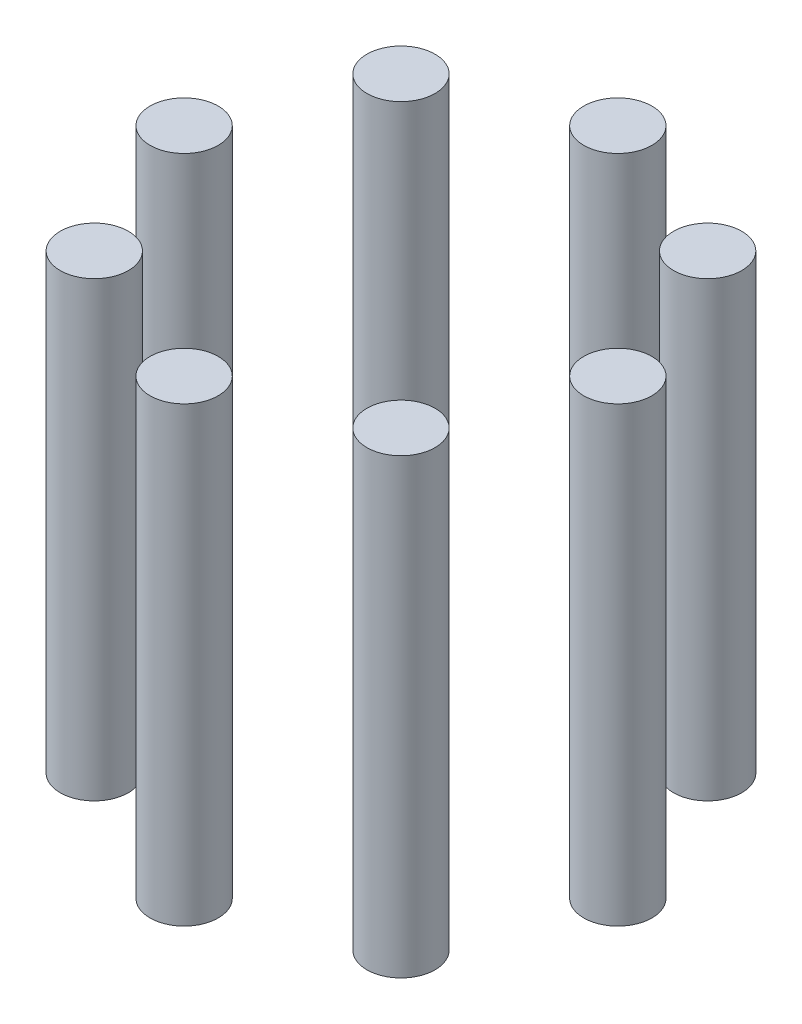
ISO-10303-21;
HEADER;
FILE_DESCRIPTION(('STEP AP214'),'2;1');
FILE_NAME('part.step','',(''),(''),'','','');
FILE_SCHEMA(('AUTOMOTIVE_DESIGN { 1 0 10303 214 1 1 1 1 }'));
ENDSEC;
DATA;
#1=APPLICATION_CONTEXT('core data for automotive mechanical design processes');
#2=APPLICATION_PROTOCOL_DEFINITION('international standard','automotive_design',2000,#1);
#3=PRODUCT_CONTEXT('',#1,'mechanical');
#4=PRODUCT('Part','Part','',(#3));
#5=PRODUCT_RELATED_PRODUCT_CATEGORY('part','',(#4));
#6=PRODUCT_DEFINITION_FORMATION('','',#4);
#7=PRODUCT_DEFINITION_CONTEXT('part definition',#1,'design');
#8=PRODUCT_DEFINITION('design','',#6,#7);
#9=PRODUCT_DEFINITION_SHAPE('','',#8);
#10=(LENGTH_UNIT() NAMED_UNIT(*) SI_UNIT(.MILLI.,.METRE.));
#11=(NAMED_UNIT(*) PLANE_ANGLE_UNIT() SI_UNIT($,.RADIAN.));
#12=(NAMED_UNIT(*) SI_UNIT($,.STERADIAN.) SOLID_ANGLE_UNIT());
#13=UNCERTAINTY_MEASURE_WITH_UNIT(LENGTH_MEASURE(1.E-05),#10,'distance_accuracy_value','');
#14=(GEOMETRIC_REPRESENTATION_CONTEXT(3) GLOBAL_UNCERTAINTY_ASSIGNED_CONTEXT((#13)) GLOBAL_UNIT_ASSIGNED_CONTEXT((#10,
#11,#12)) REPRESENTATION_CONTEXT('',''));
#15=CARTESIAN_POINT('',(0.,0.,0.));
#16=DIRECTION('',(0.,0.,1.));
#17=DIRECTION('',(1.,0.,0.));
#18=AXIS2_PLACEMENT_3D('',#15,#16,#17);
#19=CARTESIAN_POINT('',(-24.7487373415295,73.,24.7487373415289));
#20=DIRECTION('',(0.,-1.,0.));
#21=DIRECTION('',(0.,0.,-1.));
#22=AXIS2_PLACEMENT_3D('',#19,#20,#21);
#23=CYLINDRICAL_SURFACE('',#22,5.5);
#24=CARTESIAN_POINT('',(-24.7487373415295,73.,24.7487373415289));
#25=DIRECTION('',(0.,1.,0.));
#26=DIRECTION('',(0.,0.,1.));
#27=AXIS2_PLACEMENT_3D('',#24,#25,#26);
#28=CIRCLE('',#27,5.5);
#29=CARTESIAN_POINT('',(-24.7487373415295,73.,30.2487373415289));
#30=VERTEX_POINT('',#29);
#31=EDGE_CURVE('E48',#30,#30,#28,.T.);
#32=ORIENTED_EDGE('',*,*,#31,.F.);
#33=EDGE_LOOP('',(#32));
#34=FACE_BOUND('',#33,.T.);
#35=CARTESIAN_POINT('',(-24.7487373415295,0.,24.7487373415289));
#36=DIRECTION('',(0.,1.,0.));
#37=DIRECTION('',(0.,0.,1.));
#38=AXIS2_PLACEMENT_3D('',#35,#36,#37);
#39=CIRCLE('',#38,5.5);
#40=CARTESIAN_POINT('',(-24.7487373415295,0.,30.2487373415289));
#41=VERTEX_POINT('',#40);
#42=EDGE_CURVE('E11',#41,#41,#39,.T.);
#43=ORIENTED_EDGE('',*,*,#42,.T.);
#44=EDGE_LOOP('',(#43));
#45=FACE_BOUND('',#44,.T.);
#46=ADVANCED_FACE('F44',(#34,#45),#23,.T.);
#47=CARTESIAN_POINT('',(-24.7487373415295,73.,24.7487373415289));
#48=DIRECTION('',(0.,1.,0.));
#49=DIRECTION('',(0.,0.,1.));
#50=AXIS2_PLACEMENT_3D('',#47,#48,#49);
#51=PLANE('',#50);
#52=ORIENTED_EDGE('',*,*,#31,.T.);
#53=EDGE_LOOP('',(#52));
#54=FACE_BOUND('',#53,.T.);
#55=ADVANCED_FACE('F46',(#54),#51,.T.);
#56=CARTESIAN_POINT('',(-24.7487373415295,0.,24.7487373415289));
#57=DIRECTION('',(0.,1.,0.));
#58=DIRECTION('',(0.,0.,1.));
#59=AXIS2_PLACEMENT_3D('',#56,#57,#58);
#60=PLANE('',#59);
#61=ORIENTED_EDGE('',*,*,#42,.F.);
#62=EDGE_LOOP('',(#61));
#63=FACE_BOUND('',#62,.T.);
#64=ADVANCED_FACE('F63',(#63),#60,.F.);
#65=CLOSED_SHELL('',(#46,#55,#64));
#66=MANIFOLD_SOLID_BREP('B2',#65);
#67=CARTESIAN_POINT('',(-3.66605540578529E-13,73.,35.));
#68=DIRECTION('',(0.,-1.,0.));
#69=DIRECTION('',(0.,0.,-1.));
#70=AXIS2_PLACEMENT_3D('',#67,#68,#69);
#71=CYLINDRICAL_SURFACE('',#70,5.5);
#72=CARTESIAN_POINT('',(-3.66605540578529E-13,73.,35.));
#73=DIRECTION('',(0.,1.,0.));
#74=DIRECTION('',(0.,0.,1.));
#75=AXIS2_PLACEMENT_3D('',#72,#73,#74);
#76=CIRCLE('',#75,5.5);
#77=CARTESIAN_POINT('',(-3.66605540578529E-13,73.,40.5));
#78=VERTEX_POINT('',#77);
#79=EDGE_CURVE('E103',#78,#78,#76,.T.);
#80=ORIENTED_EDGE('',*,*,#79,.F.);
#81=EDGE_LOOP('',(#80));
#82=FACE_BOUND('',#81,.T.);
#83=CARTESIAN_POINT('',(-3.66605540578529E-13,0.,35.));
#84=DIRECTION('',(0.,1.,0.));
#85=DIRECTION('',(0.,0.,1.));
#86=AXIS2_PLACEMENT_3D('',#83,#84,#85);
#87=CIRCLE('',#86,5.5);
#88=CARTESIAN_POINT('',(-3.66605540578529E-13,0.,40.5));
#89=VERTEX_POINT('',#88);
#90=EDGE_CURVE('E43',#89,#89,#87,.T.);
#91=ORIENTED_EDGE('',*,*,#90,.T.);
#92=EDGE_LOOP('',(#91));
#93=FACE_BOUND('',#92,.T.);
#94=ADVANCED_FACE('F99',(#82,#93),#71,.T.);
#95=CARTESIAN_POINT('',(-3.66605540578529E-13,73.,35.));
#96=DIRECTION('',(0.,1.,0.));
#97=DIRECTION('',(0.,0.,1.));
#98=AXIS2_PLACEMENT_3D('',#95,#96,#97);
#99=PLANE('',#98);
#100=ORIENTED_EDGE('',*,*,#79,.T.);
#101=EDGE_LOOP('',(#100));
#102=FACE_BOUND('',#101,.T.);
#103=ADVANCED_FACE('F101',(#102),#99,.T.);
#104=CARTESIAN_POINT('',(-3.66605540578529E-13,0.,35.));
#105=DIRECTION('',(0.,1.,0.));
#106=DIRECTION('',(0.,0.,1.));
#107=AXIS2_PLACEMENT_3D('',#104,#105,#106);
#108=PLANE('',#107);
#109=ORIENTED_EDGE('',*,*,#90,.F.);
#110=EDGE_LOOP('',(#109));
#111=FACE_BOUND('',#110,.T.);
#112=ADVANCED_FACE('F118',(#111),#108,.F.);
#113=CLOSED_SHELL('',(#94,#103,#112));
#114=MANIFOLD_SOLID_BREP('B6',#113);
#115=CARTESIAN_POINT('',(24.748737341529,73.,24.7487373415294));
#116=DIRECTION('',(0.,-1.,0.));
#117=DIRECTION('',(0.,0.,-1.));
#118=AXIS2_PLACEMENT_3D('',#115,#116,#117);
#119=CYLINDRICAL_SURFACE('',#118,5.5);
#120=CARTESIAN_POINT('',(24.748737341529,73.,24.7487373415294));
#121=DIRECTION('',(0.,1.,0.));
#122=DIRECTION('',(0.,0.,1.));
#123=AXIS2_PLACEMENT_3D('',#120,#121,#122);
#124=CIRCLE('',#123,5.5);
#125=CARTESIAN_POINT('',(24.748737341529,73.,30.2487373415294));
#126=VERTEX_POINT('',#125);
#127=EDGE_CURVE('E158',#126,#126,#124,.T.);
#128=ORIENTED_EDGE('',*,*,#127,.F.);
#129=EDGE_LOOP('',(#128));
#130=FACE_BOUND('',#129,.T.);
#131=CARTESIAN_POINT('',(24.748737341529,0.,24.7487373415294));
#132=DIRECTION('',(0.,1.,0.));
#133=DIRECTION('',(0.,0.,1.));
#134=AXIS2_PLACEMENT_3D('',#131,#132,#133);
#135=CIRCLE('',#134,5.5);
#136=CARTESIAN_POINT('',(24.748737341529,0.,30.2487373415294));
#137=VERTEX_POINT('',#136);
#138=EDGE_CURVE('E98',#137,#137,#135,.T.);
#139=ORIENTED_EDGE('',*,*,#138,.T.);
#140=EDGE_LOOP('',(#139));
#141=FACE_BOUND('',#140,.T.);
#142=ADVANCED_FACE('F154',(#130,#141),#119,.T.);
#143=CARTESIAN_POINT('',(24.748737341529,73.,24.7487373415294));
#144=DIRECTION('',(0.,1.,0.));
#145=DIRECTION('',(0.,0.,1.));
#146=AXIS2_PLACEMENT_3D('',#143,#144,#145);
#147=PLANE('',#146);
#148=ORIENTED_EDGE('',*,*,#127,.T.);
#149=EDGE_LOOP('',(#148));
#150=FACE_BOUND('',#149,.T.);
#151=ADVANCED_FACE('F156',(#150),#147,.T.);
#152=CARTESIAN_POINT('',(24.748737341529,0.,24.7487373415294));
#153=DIRECTION('',(0.,1.,0.));
#154=DIRECTION('',(0.,0.,1.));
#155=AXIS2_PLACEMENT_3D('',#152,#153,#154);
#156=PLANE('',#155);
#157=ORIENTED_EDGE('',*,*,#138,.F.);
#158=EDGE_LOOP('',(#157));
#159=FACE_BOUND('',#158,.T.);
#160=ADVANCED_FACE('F173',(#159),#156,.F.);
#161=CLOSED_SHELL('',(#142,#151,#160));
#162=MANIFOLD_SOLID_BREP('B38',#161);
#163=CARTESIAN_POINT('',(35.,73.,2.44403693719019E-13));
#164=DIRECTION('',(0.,-1.,0.));
#165=DIRECTION('',(0.,0.,-1.));
#166=AXIS2_PLACEMENT_3D('',#163,#164,#165);
#167=CYLINDRICAL_SURFACE('',#166,5.5);
#168=CARTESIAN_POINT('',(35.,73.,2.44403693719019E-13));
#169=DIRECTION('',(0.,1.,0.));
#170=DIRECTION('',(0.,0.,1.));
#171=AXIS2_PLACEMENT_3D('',#168,#169,#170);
#172=CIRCLE('',#171,5.5);
#173=CARTESIAN_POINT('',(35.,73.,5.50000000000024));
#174=VERTEX_POINT('',#173);
#175=EDGE_CURVE('E213',#174,#174,#172,.T.);
#176=ORIENTED_EDGE('',*,*,#175,.F.);
#177=EDGE_LOOP('',(#176));
#178=FACE_BOUND('',#177,.T.);
#179=CARTESIAN_POINT('',(35.,0.,2.44403693719019E-13));
#180=DIRECTION('',(0.,1.,0.));
#181=DIRECTION('',(0.,0.,1.));
#182=AXIS2_PLACEMENT_3D('',#179,#180,#181);
#183=CIRCLE('',#182,5.5);
#184=CARTESIAN_POINT('',(35.,0.,5.50000000000024));
#185=VERTEX_POINT('',#184);
#186=EDGE_CURVE('E153',#185,#185,#183,.T.);
#187=ORIENTED_EDGE('',*,*,#186,.T.);
#188=EDGE_LOOP('',(#187));
#189=FACE_BOUND('',#188,.T.);
#190=ADVANCED_FACE('F209',(#178,#189),#167,.T.);
#191=CARTESIAN_POINT('',(35.,73.,2.44403693719019E-13));
#192=DIRECTION('',(0.,1.,0.));
#193=DIRECTION('',(0.,0.,1.));
#194=AXIS2_PLACEMENT_3D('',#191,#192,#193);
#195=PLANE('',#194);
#196=ORIENTED_EDGE('',*,*,#175,.T.);
#197=EDGE_LOOP('',(#196));
#198=FACE_BOUND('',#197,.T.);
#199=ADVANCED_FACE('F211',(#198),#195,.T.);
#200=CARTESIAN_POINT('',(35.,0.,2.44403693719019E-13));
#201=DIRECTION('',(0.,1.,0.));
#202=DIRECTION('',(0.,0.,1.));
#203=AXIS2_PLACEMENT_3D('',#200,#201,#202);
#204=PLANE('',#203);
#205=ORIENTED_EDGE('',*,*,#186,.F.);
#206=EDGE_LOOP('',(#205));
#207=FACE_BOUND('',#206,.T.);
#208=ADVANCED_FACE('F228',(#207),#204,.F.);
#209=CLOSED_SHELL('',(#190,#199,#208));
#210=MANIFOLD_SOLID_BREP('B93',#209);
#211=CARTESIAN_POINT('',(24.7487373415293,73.,-24.748737341529));
#212=DIRECTION('',(0.,-1.,0.));
#213=DIRECTION('',(0.,0.,-1.));
#214=AXIS2_PLACEMENT_3D('',#211,#212,#213);
#215=CYLINDRICAL_SURFACE('',#214,5.5);
#216=CARTESIAN_POINT('',(24.7487373415293,73.,-24.748737341529));
#217=DIRECTION('',(0.,1.,0.));
#218=DIRECTION('',(0.,0.,1.));
#219=AXIS2_PLACEMENT_3D('',#216,#217,#218);
#220=CIRCLE('',#219,5.5);
#221=CARTESIAN_POINT('',(24.7487373415293,73.,-19.248737341529));
#222=VERTEX_POINT('',#221);
#223=EDGE_CURVE('E268',#222,#222,#220,.T.);
#224=ORIENTED_EDGE('',*,*,#223,.F.);
#225=EDGE_LOOP('',(#224));
#226=FACE_BOUND('',#225,.T.);
#227=CARTESIAN_POINT('',(24.7487373415293,0.,-24.748737341529));
#228=DIRECTION('',(0.,1.,0.));
#229=DIRECTION('',(0.,0.,1.));
#230=AXIS2_PLACEMENT_3D('',#227,#228,#229);
#231=CIRCLE('',#230,5.5);
#232=CARTESIAN_POINT('',(24.7487373415293,0.,-19.248737341529));
#233=VERTEX_POINT('',#232);
#234=EDGE_CURVE('E208',#233,#233,#231,.T.);
#235=ORIENTED_EDGE('',*,*,#234,.T.);
#236=EDGE_LOOP('',(#235));
#237=FACE_BOUND('',#236,.T.);
#238=ADVANCED_FACE('F264',(#226,#237),#215,.T.);
#239=CARTESIAN_POINT('',(24.7487373415293,73.,-24.748737341529));
#240=DIRECTION('',(0.,1.,0.));
#241=DIRECTION('',(0.,0.,1.));
#242=AXIS2_PLACEMENT_3D('',#239,#240,#241);
#243=PLANE('',#242);
#244=ORIENTED_EDGE('',*,*,#223,.T.);
#245=EDGE_LOOP('',(#244));
#246=FACE_BOUND('',#245,.T.);
#247=ADVANCED_FACE('F266',(#246),#243,.T.);
#248=CARTESIAN_POINT('',(24.7487373415293,0.,-24.748737341529));
#249=DIRECTION('',(0.,1.,0.));
#250=DIRECTION('',(0.,0.,1.));
#251=AXIS2_PLACEMENT_3D('',#248,#249,#250);
#252=PLANE('',#251);
#253=ORIENTED_EDGE('',*,*,#234,.F.);
#254=EDGE_LOOP('',(#253));
#255=FACE_BOUND('',#254,.T.);
#256=ADVANCED_FACE('F283',(#255),#252,.F.);
#257=CLOSED_SHELL('',(#238,#247,#256));
#258=MANIFOLD_SOLID_BREP('B148',#257);
#259=CARTESIAN_POINT('',(1.2220184685951E-13,73.,-35.));
#260=DIRECTION('',(0.,-1.,0.));
#261=DIRECTION('',(0.,0.,-1.));
#262=AXIS2_PLACEMENT_3D('',#259,#260,#261);
#263=CYLINDRICAL_SURFACE('',#262,5.5);
#264=CARTESIAN_POINT('',(1.2220184685951E-13,73.,-35.));
#265=DIRECTION('',(0.,1.,0.));
#266=DIRECTION('',(0.,0.,1.));
#267=AXIS2_PLACEMENT_3D('',#264,#265,#266);
#268=CIRCLE('',#267,5.5);
#269=CARTESIAN_POINT('',(1.2220184685951E-13,73.,-29.5));
#270=VERTEX_POINT('',#269);
#271=EDGE_CURVE('E323',#270,#270,#268,.T.);
#272=ORIENTED_EDGE('',*,*,#271,.F.);
#273=EDGE_LOOP('',(#272));
#274=FACE_BOUND('',#273,.T.);
#275=CARTESIAN_POINT('',(1.2220184685951E-13,0.,-35.));
#276=DIRECTION('',(0.,1.,0.));
#277=DIRECTION('',(0.,0.,1.));
#278=AXIS2_PLACEMENT_3D('',#275,#276,#277);
#279=CIRCLE('',#278,5.5);
#280=CARTESIAN_POINT('',(1.2220184685951E-13,0.,-29.5));
#281=VERTEX_POINT('',#280);
#282=EDGE_CURVE('E263',#281,#281,#279,.T.);
#283=ORIENTED_EDGE('',*,*,#282,.T.);
#284=EDGE_LOOP('',(#283));
#285=FACE_BOUND('',#284,.T.);
#286=ADVANCED_FACE('F319',(#274,#285),#263,.T.);
#287=CARTESIAN_POINT('',(1.2220184685951E-13,73.,-35.));
#288=DIRECTION('',(0.,1.,0.));
#289=DIRECTION('',(0.,0.,1.));
#290=AXIS2_PLACEMENT_3D('',#287,#288,#289);
#291=PLANE('',#290);
#292=ORIENTED_EDGE('',*,*,#271,.T.);
#293=EDGE_LOOP('',(#292));
#294=FACE_BOUND('',#293,.T.);
#295=ADVANCED_FACE('F321',(#294),#291,.T.);
#296=CARTESIAN_POINT('',(1.2220184685951E-13,0.,-35.));
#297=DIRECTION('',(0.,1.,0.));
#298=DIRECTION('',(0.,0.,1.));
#299=AXIS2_PLACEMENT_3D('',#296,#297,#298);
#300=PLANE('',#299);
#301=ORIENTED_EDGE('',*,*,#282,.F.);
#302=EDGE_LOOP('',(#301));
#303=FACE_BOUND('',#302,.T.);
#304=ADVANCED_FACE('F338',(#303),#300,.F.);
#305=CLOSED_SHELL('',(#286,#295,#304));
#306=MANIFOLD_SOLID_BREP('B203',#305);
#307=CARTESIAN_POINT('',(-24.7487373415291,73.,-24.7487373415292));
#308=DIRECTION('',(0.,-1.,0.));
#309=DIRECTION('',(0.,0.,-1.));
#310=AXIS2_PLACEMENT_3D('',#307,#308,#309);
#311=CYLINDRICAL_SURFACE('',#310,5.5);
#312=CARTESIAN_POINT('',(-24.7487373415291,73.,-24.7487373415292));
#313=DIRECTION('',(0.,1.,0.));
#314=DIRECTION('',(0.,0.,1.));
#315=AXIS2_PLACEMENT_3D('',#312,#313,#314);
#316=CIRCLE('',#315,5.5);
#317=CARTESIAN_POINT('',(-24.7487373415291,73.,-19.2487373415292));
#318=VERTEX_POINT('',#317);
#319=EDGE_CURVE('E377',#318,#318,#316,.T.);
#320=ORIENTED_EDGE('',*,*,#319,.F.);
#321=EDGE_LOOP('',(#320));
#322=FACE_BOUND('',#321,.T.);
#323=CARTESIAN_POINT('',(-24.7487373415291,0.,-24.7487373415292));
#324=DIRECTION('',(0.,1.,0.));
#325=DIRECTION('',(0.,0.,1.));
#326=AXIS2_PLACEMENT_3D('',#323,#324,#325);
#327=CIRCLE('',#326,5.5);
#328=CARTESIAN_POINT('',(-24.7487373415291,0.,-19.2487373415292));
#329=VERTEX_POINT('',#328);
#330=EDGE_CURVE('E318',#329,#329,#327,.T.);
#331=ORIENTED_EDGE('',*,*,#330,.T.);
#332=EDGE_LOOP('',(#331));
#333=FACE_BOUND('',#332,.T.);
#334=ADVANCED_FACE('F373',(#322,#333),#311,.T.);
#335=CARTESIAN_POINT('',(-24.7487373415291,73.,-24.7487373415292));
#336=DIRECTION('',(0.,1.,0.));
#337=DIRECTION('',(0.,0.,1.));
#338=AXIS2_PLACEMENT_3D('',#335,#336,#337);
#339=PLANE('',#338);
#340=ORIENTED_EDGE('',*,*,#319,.T.);
#341=EDGE_LOOP('',(#340));
#342=FACE_BOUND('',#341,.T.);
#343=ADVANCED_FACE('F375',(#342),#339,.T.);
#344=CARTESIAN_POINT('',(-24.7487373415291,0.,-24.7487373415292));
#345=DIRECTION('',(0.,1.,0.));
#346=DIRECTION('',(0.,0.,1.));
#347=AXIS2_PLACEMENT_3D('',#344,#345,#346);
#348=PLANE('',#347);
#349=ORIENTED_EDGE('',*,*,#330,.F.);
#350=EDGE_LOOP('',(#349));
#351=FACE_BOUND('',#350,.T.);
#352=ADVANCED_FACE('F392',(#351),#348,.F.);
#353=CLOSED_SHELL('',(#334,#343,#352));
#354=MANIFOLD_SOLID_BREP('B258',#353);
#355=CARTESIAN_POINT('',(-35.,73.,0.));
#356=DIRECTION('',(0.,-1.,0.));
#357=DIRECTION('',(0.,0.,-1.));
#358=AXIS2_PLACEMENT_3D('',#355,#356,#357);
#359=CYLINDRICAL_SURFACE('',#358,5.5);
#360=CARTESIAN_POINT('',(-35.,73.,0.));
#361=DIRECTION('',(0.,1.,0.));
#362=DIRECTION('',(0.,0.,1.));
#363=AXIS2_PLACEMENT_3D('',#360,#361,#362);
#364=CIRCLE('',#363,5.5);
#365=CARTESIAN_POINT('',(-35.,73.,5.5));
#366=VERTEX_POINT('',#365);
#367=EDGE_CURVE('E372',#366,#366,#364,.T.);
#368=ORIENTED_EDGE('',*,*,#367,.F.);
#369=EDGE_LOOP('',(#368));
#370=FACE_BOUND('',#369,.T.);
#371=CARTESIAN_POINT('',(-35.,0.,0.));
#372=DIRECTION('',(0.,1.,0.));
#373=DIRECTION('',(0.,0.,1.));
#374=AXIS2_PLACEMENT_3D('',#371,#372,#373);
#375=CIRCLE('',#374,5.5);
#376=CARTESIAN_POINT('',(-35.,0.,5.5));
#377=VERTEX_POINT('',#376);
#378=EDGE_CURVE('E423',#377,#377,#375,.T.);
#379=ORIENTED_EDGE('',*,*,#378,.T.);
#380=EDGE_LOOP('',(#379));
#381=FACE_BOUND('',#380,.T.);
#382=ADVANCED_FACE('F420',(#370,#381),#359,.T.);
#383=CARTESIAN_POINT('',(-35.,73.,0.));
#384=DIRECTION('',(0.,1.,0.));
#385=DIRECTION('',(0.,0.,1.));
#386=AXIS2_PLACEMENT_3D('',#383,#384,#385);
#387=PLANE('',#386);
#388=ORIENTED_EDGE('',*,*,#367,.T.);
#389=EDGE_LOOP('',(#388));
#390=FACE_BOUND('',#389,.T.);
#391=ADVANCED_FACE('F435',(#390),#387,.T.);
#392=CARTESIAN_POINT('',(-35.,0.,0.));
#393=DIRECTION('',(0.,1.,0.));
#394=DIRECTION('',(0.,0.,1.));
#395=AXIS2_PLACEMENT_3D('',#392,#393,#394);
#396=PLANE('',#395);
#397=ORIENTED_EDGE('',*,*,#378,.F.);
#398=EDGE_LOOP('',(#397));
#399=FACE_BOUND('',#398,.T.);
#400=ADVANCED_FACE('F433',(#399),#396,.F.);
#401=CLOSED_SHELL('',(#382,#391,#400));
#402=MANIFOLD_SOLID_BREP('B313',#401);
#403=ADVANCED_BREP_SHAPE_REPRESENTATION('',(#18,#66,#114,#162,#210,#258,#306,#354,#402),#14);
#404=SHAPE_DEFINITION_REPRESENTATION(#9,#403);
ENDSEC;
END-ISO-10303-21;
